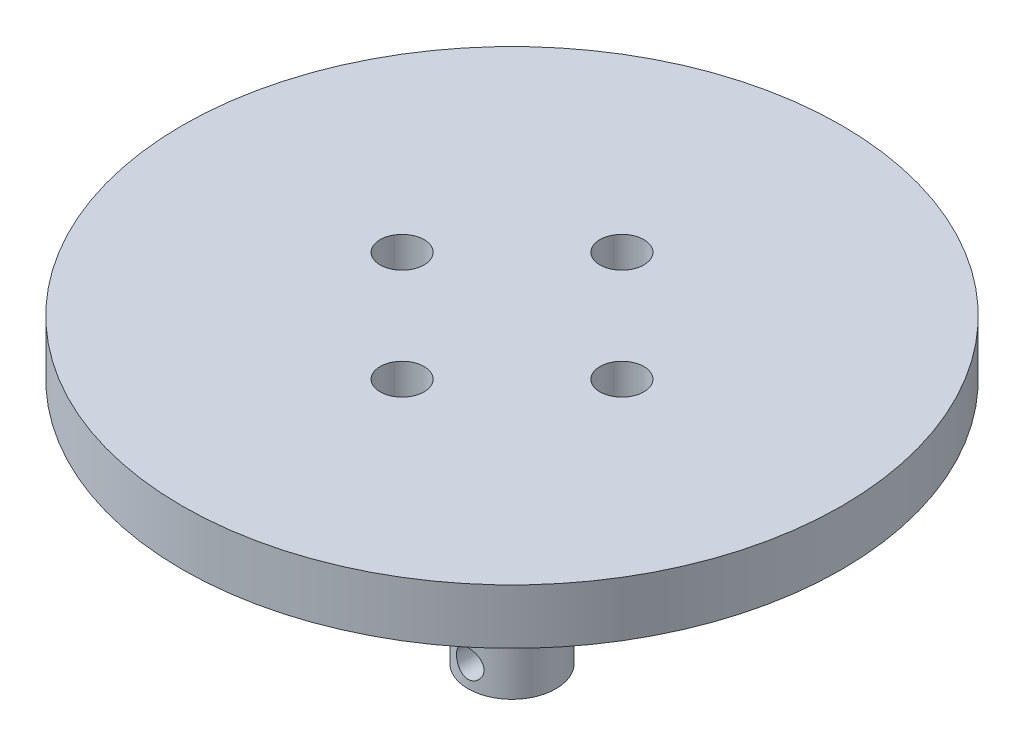
ISO-10303-21;
HEADER;
FILE_DESCRIPTION(('STEP AP214'),'2;1');
FILE_NAME('part.step','',(''),(''),'','','');
FILE_SCHEMA(('AUTOMOTIVE_DESIGN { 1 0 10303 214 1 1 1 1 }'));
ENDSEC;
DATA;
#1=APPLICATION_CONTEXT('core data for automotive mechanical design processes');
#2=APPLICATION_PROTOCOL_DEFINITION('international standard','automotive_design',2000,#1);
#3=PRODUCT_CONTEXT('',#1,'mechanical');
#4=PRODUCT('Part','Part','',(#3));
#5=PRODUCT_RELATED_PRODUCT_CATEGORY('part','',(#4));
#6=PRODUCT_DEFINITION_FORMATION('','',#4);
#7=PRODUCT_DEFINITION_CONTEXT('part definition',#1,'design');
#8=PRODUCT_DEFINITION('design','',#6,#7);
#9=PRODUCT_DEFINITION_SHAPE('','',#8);
#10=(LENGTH_UNIT() NAMED_UNIT(*) SI_UNIT(.MILLI.,.METRE.));
#11=(NAMED_UNIT(*) PLANE_ANGLE_UNIT() SI_UNIT($,.RADIAN.));
#12=(NAMED_UNIT(*) SI_UNIT($,.STERADIAN.) SOLID_ANGLE_UNIT());
#13=UNCERTAINTY_MEASURE_WITH_UNIT(LENGTH_MEASURE(1.E-05),#10,'distance_accuracy_value','');
#14=(GEOMETRIC_REPRESENTATION_CONTEXT(3) GLOBAL_UNCERTAINTY_ASSIGNED_CONTEXT((#13)) GLOBAL_UNIT_ASSIGNED_CONTEXT((#10,
#11,#12)) REPRESENTATION_CONTEXT('',''));
#15=CARTESIAN_POINT('',(0.,0.,0.));
#16=DIRECTION('',(0.,0.,1.));
#17=DIRECTION('',(1.,0.,0.));
#18=AXIS2_PLACEMENT_3D('',#15,#16,#17);
#19=CARTESIAN_POINT('',(0.,25.4,0.));
#20=DIRECTION('',(0.,-1.,0.));
#21=DIRECTION('',(0.,0.,-1.));
#22=AXIS2_PLACEMENT_3D('',#19,#20,#21);
#23=CYLINDRICAL_SURFACE('',#22,4.);
#24=CARTESIAN_POINT('',(0.,3.,0.));
#25=DIRECTION('',(0.,1.,0.));
#26=DIRECTION('',(0.,0.,1.));
#27=AXIS2_PLACEMENT_3D('',#24,#25,#26);
#28=CIRCLE('',#27,4.);
#29=CARTESIAN_POINT('',(0.,3.,4.));
#30=VERTEX_POINT('',#29);
#31=EDGE_CURVE('E78',#30,#30,#28,.T.);
#32=ORIENTED_EDGE('',*,*,#31,.T.);
#33=EDGE_LOOP('',(#32));
#34=FACE_BOUND('',#33,.T.);
#35=CARTESIAN_POINT('',(0.,25.4,0.));
#36=DIRECTION('',(0.,1.,0.));
#37=DIRECTION('',(0.,0.,1.));
#38=AXIS2_PLACEMENT_3D('',#35,#36,#37);
#39=CIRCLE('',#38,4.);
#40=CARTESIAN_POINT('',(0.,25.4,4.));
#41=VERTEX_POINT('',#40);
#42=EDGE_CURVE('E46',#41,#41,#39,.T.);
#43=ORIENTED_EDGE('',*,*,#42,.F.);
#44=EDGE_LOOP('',(#43));
#45=FACE_BOUND('',#44,.T.);
#46=CARTESIAN_POINT('',(-1.25,5.,3.79967103839267));
#47=CARTESIAN_POINT('',(-1.24999953780047,4.93165296389066,3.79967145961936));
#48=CARTESIAN_POINT('',(-1.24437538791495,4.8633012312968,3.80153531505043));
#49=CARTESIAN_POINT('',(-1.22209175401327,4.72860583912219,3.80875638998877));
#50=CARTESIAN_POINT('',(-1.20542928782515,4.66226272726784,3.81411455353136));
#51=CARTESIAN_POINT('',(-1.16169788223559,4.533555098068,3.8276593883596));
#52=CARTESIAN_POINT('',(-1.13464735736677,4.47118376689432,3.83584105194317));
#53=CARTESIAN_POINT('',(-1.07096914173157,4.35184730413599,3.85410406218688));
#54=CARTESIAN_POINT('',(-1.03433975905632,4.29488313003988,3.86418574435841));
#55=CARTESIAN_POINT('',(-0.951196070622293,4.18602113250651,3.8855012766862));
#56=CARTESIAN_POINT('',(-0.904409399720398,4.13433639056401,3.8967612338478));
#57=CARTESIAN_POINT('',(-0.802862046455494,4.03940398679081,3.91894245860336));
#58=CARTESIAN_POINT('',(-0.748100252518564,3.99615750305515,3.92986367872627));
#59=CARTESIAN_POINT('',(-0.630625912493362,3.91838893698875,3.95043553390078));
#60=CARTESIAN_POINT('',(-0.567761556520094,3.88408629616854,3.9600518456278));
#61=CARTESIAN_POINT('',(-0.436804232853403,3.82662395014445,3.97662551833019));
#62=CARTESIAN_POINT('',(-0.368712498487051,3.80346162585041,3.98358350419919));
#63=CARTESIAN_POINT('',(-0.231464356966097,3.76964887190293,3.99387175820863));
#64=CARTESIAN_POINT('',(-0.162405715468215,3.75863425021215,3.99730738984143));
#65=CARTESIAN_POINT('',(-0.02334081398452,3.74827565356247,4.00053595876015));
#66=CARTESIAN_POINT('',(0.0466652269730837,3.74892902564117,4.00032972410065));
#67=CARTESIAN_POINT('',(0.183074480354735,3.76164829158595,3.99637116132537));
#68=CARTESIAN_POINT('',(0.249518634314044,3.77331938351302,3.99274150972157));
#69=CARTESIAN_POINT('',(0.37945306334777,3.807094990043,3.98249482560855));
#70=CARTESIAN_POINT('',(0.442943145481196,3.82920018508655,3.97587759827134));
#71=CARTESIAN_POINT('',(0.566078103154782,3.88347018907488,3.96023459729533));
#72=CARTESIAN_POINT('',(0.625666405622831,3.91575480856303,3.95118033616957));
#73=CARTESIAN_POINT('',(0.73870251115203,3.98937109970456,3.93161722953562));
#74=CARTESIAN_POINT('',(0.792148756208838,4.03070505913784,3.92110801644584));
#75=CARTESIAN_POINT('',(0.893737698453881,4.12327363480129,3.89923670734646));
#76=CARTESIAN_POINT('',(0.941566549094178,4.1748490688412,3.88785731989084));
#77=CARTESIAN_POINT('',(1.02798974259538,4.28539510182446,3.86590615440412));
#78=CARTESIAN_POINT('',(1.06658299775341,4.344366570575,3.85533447159847));
#79=CARTESIAN_POINT('',(1.13380465019766,4.46891746885984,3.83610846648974));
#80=CARTESIAN_POINT('',(1.16231680702682,4.53456340904239,3.82747690354324));
#81=CARTESIAN_POINT('',(1.20778345948513,4.67005949189535,3.81337545338913));
#82=CARTESIAN_POINT('',(1.22474210765793,4.73990811421048,3.80790443033294));
#83=CARTESIAN_POINT('',(1.24601485185709,4.87881995256584,3.80099563391872));
#84=CARTESIAN_POINT('',(1.25080954353711,4.94780199623211,3.79940466389696));
#85=CARTESIAN_POINT('',(1.24896744498307,5.08558974149816,3.80001077463984));
#86=CARTESIAN_POINT('',(1.24233242111456,5.15439546870047,3.80220727008389));
#87=CARTESIAN_POINT('',(1.21824873513143,5.28780829665165,3.80998957482874));
#88=CARTESIAN_POINT('',(1.20111831160538,5.35247927407399,3.81547554101732));
#89=CARTESIAN_POINT('',(1.15690373661028,5.47802179199604,3.82911287331661));
#90=CARTESIAN_POINT('',(1.12981796171155,5.53889271092119,3.83726467412388));
#91=CARTESIAN_POINT('',(1.06557510655875,5.65703910977175,3.85560539653156));
#92=CARTESIAN_POINT('',(1.02815147488557,5.71416141559278,3.86584603489733));
#93=CARTESIAN_POINT('',(0.944606408679811,5.82149034636192,3.88710348972828));
#94=CARTESIAN_POINT('',(0.898482714690783,5.87169516892534,3.89812050735703));
#95=CARTESIAN_POINT('',(0.796572947753604,5.96591036591282,3.92024187562679));
#96=CARTESIAN_POINT('',(0.740465649788521,6.00957778613987,3.93133092285679));
#97=CARTESIAN_POINT('',(0.621451545651398,6.08689104332126,3.95189059843678));
#98=CARTESIAN_POINT('',(0.558545051108623,6.12053733931104,3.96136130090946));
#99=CARTESIAN_POINT('',(0.428105523331831,6.17653056247168,3.97756311928512));
#100=CARTESIAN_POINT('',(0.360610184283755,6.19895928784368,3.984313995612));
#101=CARTESIAN_POINT('',(0.222557254056389,6.23207253858971,3.99440242648576));
#102=CARTESIAN_POINT('',(0.152000628340356,6.2427607390835,3.99774104914277));
#103=CARTESIAN_POINT('',(0.0129849366488985,6.25179100174962,4.00055803404462));
#104=CARTESIAN_POINT('',(-0.0554391919465228,6.25062845017076,4.0001912940739));
#105=CARTESIAN_POINT('',(-0.191073221923249,6.2371881889513,3.99600978081049));
#106=CARTESIAN_POINT('',(-0.258283202179569,6.22491120400805,3.99219523232619));
#107=CARTESIAN_POINT('',(-0.388755118480791,6.18990599077772,3.98159570844796));
#108=CARTESIAN_POINT('',(-0.452055918449481,6.16731039215463,3.97484847960205));
#109=CARTESIAN_POINT('',(-0.573998425500091,6.11242917279152,3.9590794558795));
#110=CARTESIAN_POINT('',(-0.632639331274482,6.08014189002657,3.95005727091358));
#111=CARTESIAN_POINT('',(-0.745761694969689,6.00552724165556,3.93029896883376));
#112=CARTESIAN_POINT('',(-0.800034607053111,5.96289647753603,3.91951509750962));
#113=CARTESIAN_POINT('',(-0.900820791399319,5.86934011055654,3.89758736547061));
#114=CARTESIAN_POINT('',(-0.94733173350416,5.81841202586061,3.88644339784826));
#115=CARTESIAN_POINT('',(-1.03282865911253,5.7076842801589,3.86461892577438));
#116=CARTESIAN_POINT('',(-1.07151427994711,5.64764659688342,3.85396600863456));
#117=CARTESIAN_POINT('',(-1.13820470748522,5.52160187973086,3.83480125279531));
#118=CARTESIAN_POINT('',(-1.16621383403546,5.45559727354975,3.82628854861386));
#119=CARTESIAN_POINT('',(-1.20871180435792,5.32527738268533,3.81306560440328));
#120=CARTESIAN_POINT('',(-1.22414939837873,5.26129745254844,3.80809315043749));
#121=CARTESIAN_POINT('',(-1.244792458161,5.13154616790351,3.80139606482399));
#122=CARTESIAN_POINT('',(-1.25000044480778,5.0657752587985,3.79967063301598));
#123=CARTESIAN_POINT('',(-1.25,5.,3.79967103839267));
#124=B_SPLINE_CURVE_WITH_KNOTS('',3,(#46,#47,#48,#49,#50,#51,#52,#53,#54,#55,#56,#57,#58,#59,
#60,#61,#62,#63,#64,#65,#66,#67,#68,#69,#70,#71,#72,#73,#74,#75,#76,#77,#78,#79,#80,#81,#82,#83,
#84,#85,#86,#87,#88,#89,#90,#91,#92,#93,#94,#95,#96,#97,#98,#99,#100,#101,#102,#103,#104,#105,
#106,#107,#108,#109,#110,#111,#112,#113,#114,#115,#116,#117,#118,#119,#120,#121,#122,#123),
.UNSPECIFIED.,.T.,.F.,(4,2,2,2,2,2,2,2,2,2,2,2,2,2,2,2,2,2,2,2,2,2,2,2,2,2,2,2,2,2,2,2,2,2,2,2,
2,2,4),(0.,0.20479813754849,0.409651627059736,0.614143644118582,0.818671804924948,
1.02957080550838,1.24049922941123,1.45619821963733,1.67184647417922,1.88083722835534,
2.08978046471775,2.29150982969751,2.49325235190093,2.69746404608409,2.90172742713188,
3.11450338937334,3.32730439853776,3.54248470934454,3.75758763952753,3.96404933287936,
4.1704791221909,4.37093972044363,4.5714330225321,4.77767613309611,4.9839728801188,
5.19881937811511,5.41365603317087,5.62690239290998,5.84008198140585,6.04438802439525,
6.24868074692307,6.4504184651476,6.65219079911652,6.86080693105215,7.06948557772191,
7.28507795501705,7.50058300803822,7.69772354371386,7.89481549188779),.UNSPECIFIED.);
#125=CARTESIAN_POINT('',(-1.25,5.,3.79967103839267));
#126=VERTEX_POINT('',#125);
#127=EDGE_CURVE('E67',#126,#126,#124,.T.);
#128=ORIENTED_EDGE('',*,*,#127,.F.);
#129=EDGE_LOOP('',(#128));
#130=FACE_BOUND('',#129,.T.);
#131=ADVANCED_FACE('F37',(#34,#45,#130),#23,.T.);
#132=CARTESIAN_POINT('',(0.,30.4,0.));
#133=DIRECTION('',(0.,-1.,0.));
#134=DIRECTION('',(0.,0.,-1.));
#135=AXIS2_PLACEMENT_3D('',#132,#133,#134);
#136=CYLINDRICAL_SURFACE('',#135,30.);
#137=CARTESIAN_POINT('',(0.,30.4,0.));
#138=DIRECTION('',(0.,1.,0.));
#139=DIRECTION('',(0.,0.,1.));
#140=AXIS2_PLACEMENT_3D('',#137,#138,#139);
#141=CIRCLE('',#140,30.);
#142=CARTESIAN_POINT('',(0.,30.4,30.));
#143=VERTEX_POINT('',#142);
#144=EDGE_CURVE('E101',#143,#143,#141,.T.);
#145=ORIENTED_EDGE('',*,*,#144,.F.);
#146=EDGE_LOOP('',(#145));
#147=FACE_BOUND('',#146,.T.);
#148=CARTESIAN_POINT('',(0.,25.4,0.));
#149=DIRECTION('',(0.,1.,0.));
#150=DIRECTION('',(0.,0.,1.));
#151=AXIS2_PLACEMENT_3D('',#148,#149,#150);
#152=CIRCLE('',#151,30.);
#153=CARTESIAN_POINT('',(0.,25.4,30.));
#154=VERTEX_POINT('',#153);
#155=EDGE_CURVE('E88',#154,#154,#152,.T.);
#156=ORIENTED_EDGE('',*,*,#155,.T.);
#157=EDGE_LOOP('',(#156));
#158=FACE_BOUND('',#157,.T.);
#159=ADVANCED_FACE('F158',(#147,#158),#136,.T.);
#160=CARTESIAN_POINT('',(0.,30.4,0.));
#161=DIRECTION('',(0.,1.,0.));
#162=DIRECTION('',(0.,0.,1.));
#163=AXIS2_PLACEMENT_3D('',#160,#161,#162);
#164=PLANE('',#163);
#165=CARTESIAN_POINT('',(0.,30.4,-10.));
#166=DIRECTION('',(0.,1.,0.));
#167=DIRECTION('',(0.,0.,1.));
#168=AXIS2_PLACEMENT_3D('',#165,#166,#167);
#169=CIRCLE('',#168,2.);
#170=CARTESIAN_POINT('',(0.,30.4,-8.));
#171=VERTEX_POINT('',#170);
#172=EDGE_CURVE('E98',#171,#171,#169,.T.);
#173=ORIENTED_EDGE('',*,*,#172,.F.);
#174=EDGE_LOOP('',(#173));
#175=FACE_BOUND('',#174,.T.);
#176=CARTESIAN_POINT('',(10.0000000000003,30.4,-2.82380124105319E-13));
#177=DIRECTION('',(0.,1.,0.));
#178=DIRECTION('',(0.,0.,1.));
#179=AXIS2_PLACEMENT_3D('',#176,#177,#178);
#180=CIRCLE('',#179,2.00000000000022);
#181=CARTESIAN_POINT('',(10.0000000000003,30.4,1.99999999999994));
#182=VERTEX_POINT('',#181);
#183=EDGE_CURVE('E111',#182,#182,#180,.T.);
#184=ORIENTED_EDGE('',*,*,#183,.F.);
#185=EDGE_LOOP('',(#184));
#186=FACE_BOUND('',#185,.T.);
#187=CARTESIAN_POINT('',(5.64760248210638E-13,30.4,10.));
#188=DIRECTION('',(0.,1.,0.));
#189=DIRECTION('',(0.,0.,1.));
#190=AXIS2_PLACEMENT_3D('',#187,#188,#189);
#191=CIRCLE('',#190,2.00000000000061);
#192=CARTESIAN_POINT('',(5.64760248210638E-13,30.4,12.0000000000006));
#193=VERTEX_POINT('',#192);
#194=EDGE_CURVE('E108',#193,#193,#191,.T.);
#195=ORIENTED_EDGE('',*,*,#194,.F.);
#196=EDGE_LOOP('',(#195));
#197=FACE_BOUND('',#196,.T.);
#198=CARTESIAN_POINT('',(-9.99999999999972,30.4,2.83604770904466E-13));
#199=DIRECTION('',(0.,1.,0.));
#200=DIRECTION('',(0.,0.,1.));
#201=AXIS2_PLACEMENT_3D('',#198,#199,#200);
#202=CIRCLE('',#201,2.00000000000045);
#203=CARTESIAN_POINT('',(-9.99999999999972,30.4,2.00000000000074));
#204=VERTEX_POINT('',#203);
#205=EDGE_CURVE('E81',#204,#204,#202,.T.);
#206=ORIENTED_EDGE('',*,*,#205,.F.);
#207=EDGE_LOOP('',(#206));
#208=FACE_BOUND('',#207,.T.);
#209=ORIENTED_EDGE('',*,*,#144,.T.);
#210=EDGE_LOOP('',(#209));
#211=FACE_BOUND('',#210,.T.);
#212=ADVANCED_FACE('F155',(#175,#186,#197,#208,#211),#164,.T.);
#213=CARTESIAN_POINT('',(0.,25.4,0.));
#214=DIRECTION('',(0.,1.,0.));
#215=DIRECTION('',(0.,0.,1.));
#216=AXIS2_PLACEMENT_3D('',#213,#214,#215);
#217=PLANE('',#216);
#218=CARTESIAN_POINT('',(0.,25.4,-10.));
#219=DIRECTION('',(0.,1.,0.));
#220=DIRECTION('',(0.,0.,1.));
#221=AXIS2_PLACEMENT_3D('',#218,#219,#220);
#222=CIRCLE('',#221,2.);
#223=CARTESIAN_POINT('',(0.,25.4,-8.));
#224=VERTEX_POINT('',#223);
#225=EDGE_CURVE('E85',#224,#224,#222,.T.);
#226=ORIENTED_EDGE('',*,*,#225,.T.);
#227=EDGE_LOOP('',(#226));
#228=FACE_BOUND('',#227,.T.);
#229=CARTESIAN_POINT('',(10.0000000000003,25.4,-2.82380124105319E-13));
#230=DIRECTION('',(0.,1.,0.));
#231=DIRECTION('',(0.,0.,1.));
#232=AXIS2_PLACEMENT_3D('',#229,#230,#231);
#233=CIRCLE('',#232,2.00000000000022);
#234=CARTESIAN_POINT('',(10.0000000000003,25.4,1.99999999999994));
#235=VERTEX_POINT('',#234);
#236=EDGE_CURVE('E89',#235,#235,#233,.T.);
#237=ORIENTED_EDGE('',*,*,#236,.T.);
#238=EDGE_LOOP('',(#237));
#239=FACE_BOUND('',#238,.T.);
#240=CARTESIAN_POINT('',(5.64760248210638E-13,25.4,10.));
#241=DIRECTION('',(0.,1.,0.));
#242=DIRECTION('',(0.,0.,1.));
#243=AXIS2_PLACEMENT_3D('',#240,#241,#242);
#244=CIRCLE('',#243,2.00000000000061);
#245=CARTESIAN_POINT('',(5.64760248210638E-13,25.4,12.0000000000006));
#246=VERTEX_POINT('',#245);
#247=EDGE_CURVE('E92',#246,#246,#244,.T.);
#248=ORIENTED_EDGE('',*,*,#247,.T.);
#249=EDGE_LOOP('',(#248));
#250=FACE_BOUND('',#249,.T.);
#251=CARTESIAN_POINT('',(-9.99999999999972,25.4,2.83604770904466E-13));
#252=DIRECTION('',(0.,1.,0.));
#253=DIRECTION('',(0.,0.,1.));
#254=AXIS2_PLACEMENT_3D('',#251,#252,#253);
#255=CIRCLE('',#254,2.00000000000045);
#256=CARTESIAN_POINT('',(-9.99999999999972,25.4,2.00000000000074));
#257=VERTEX_POINT('',#256);
#258=EDGE_CURVE('E95',#257,#257,#255,.T.);
#259=ORIENTED_EDGE('',*,*,#258,.T.);
#260=EDGE_LOOP('',(#259));
#261=FACE_BOUND('',#260,.T.);
#262=ORIENTED_EDGE('',*,*,#42,.T.);
#263=EDGE_LOOP('',(#262));
#264=FACE_BOUND('',#263,.T.);
#265=ORIENTED_EDGE('',*,*,#155,.F.);
#266=EDGE_LOOP('',(#265));
#267=FACE_BOUND('',#266,.T.);
#268=ADVANCED_FACE('F153',(#228,#239,#250,#261,#264,#267),#217,.F.);
#269=CARTESIAN_POINT('',(-9.99999999999972,22.9,2.83604770904466E-13));
#270=DIRECTION('',(0.,1.,0.));
#271=DIRECTION('',(0.,0.,1.));
#272=AXIS2_PLACEMENT_3D('',#269,#270,#271);
#273=CYLINDRICAL_SURFACE('',#272,2.00000000000045);
#274=ORIENTED_EDGE('',*,*,#205,.T.);
#275=EDGE_LOOP('',(#274));
#276=FACE_BOUND('',#275,.T.);
#277=ORIENTED_EDGE('',*,*,#258,.F.);
#278=EDGE_LOOP('',(#277));
#279=FACE_BOUND('',#278,.T.);
#280=ADVANCED_FACE('F149',(#276,#279),#273,.F.);
#281=CARTESIAN_POINT('',(5.64760248210638E-13,22.9,10.));
#282=DIRECTION('',(0.,1.,0.));
#283=DIRECTION('',(0.,0.,1.));
#284=AXIS2_PLACEMENT_3D('',#281,#282,#283);
#285=CYLINDRICAL_SURFACE('',#284,2.00000000000061);
#286=ORIENTED_EDGE('',*,*,#194,.T.);
#287=EDGE_LOOP('',(#286));
#288=FACE_BOUND('',#287,.T.);
#289=ORIENTED_EDGE('',*,*,#247,.F.);
#290=EDGE_LOOP('',(#289));
#291=FACE_BOUND('',#290,.T.);
#292=ADVANCED_FACE('F145',(#288,#291),#285,.F.);
#293=CARTESIAN_POINT('',(10.0000000000003,22.9,-2.82380124105319E-13));
#294=DIRECTION('',(0.,1.,0.));
#295=DIRECTION('',(0.,0.,1.));
#296=AXIS2_PLACEMENT_3D('',#293,#294,#295);
#297=CYLINDRICAL_SURFACE('',#296,2.00000000000022);
#298=ORIENTED_EDGE('',*,*,#183,.T.);
#299=EDGE_LOOP('',(#298));
#300=FACE_BOUND('',#299,.T.);
#301=ORIENTED_EDGE('',*,*,#236,.F.);
#302=EDGE_LOOP('',(#301));
#303=FACE_BOUND('',#302,.T.);
#304=ADVANCED_FACE('F141',(#300,#303),#297,.F.);
#305=CARTESIAN_POINT('',(0.,22.9,-10.));
#306=DIRECTION('',(0.,1.,0.));
#307=DIRECTION('',(0.,0.,1.));
#308=AXIS2_PLACEMENT_3D('',#305,#306,#307);
#309=CYLINDRICAL_SURFACE('',#308,2.);
#310=ORIENTED_EDGE('',*,*,#172,.T.);
#311=EDGE_LOOP('',(#310));
#312=FACE_BOUND('',#311,.T.);
#313=ORIENTED_EDGE('',*,*,#225,.F.);
#314=EDGE_LOOP('',(#313));
#315=FACE_BOUND('',#314,.T.);
#316=ADVANCED_FACE('F138',(#312,#315),#309,.F.);
#317=CARTESIAN_POINT('',(0.,3.,0.));
#318=DIRECTION('',(0.,-1.,0.));
#319=DIRECTION('',(0.,0.,-1.));
#320=AXIS2_PLACEMENT_3D('',#317,#318,#319);
#321=PLANE('',#320);
#322=CARTESIAN_POINT('',(0.,3.,0.));
#323=DIRECTION('',(0.,-1.,0.));
#324=DIRECTION('',(0.,0.,-1.));
#325=AXIS2_PLACEMENT_3D('',#322,#323,#324);
#326=CIRCLE('',#325,2.05);
#327=CARTESIAN_POINT('',(1.28160056179763,3.,1.6));
#328=VERTEX_POINT('',#327);
#329=CARTESIAN_POINT('',(-1.28160056179763,3.,1.6));
#330=VERTEX_POINT('',#329);
#331=EDGE_CURVE('E72',#328,#330,#326,.F.);
#332=ORIENTED_EDGE('',*,*,#331,.T.);
#333=DIRECTION('',(1.,0.,0.));
#334=VECTOR('',#333,1.);
#335=CARTESIAN_POINT('',(0.,3.,1.6));
#336=LINE('',#335,#334);
#337=EDGE_CURVE('E61',#330,#328,#336,.T.);
#338=ORIENTED_EDGE('',*,*,#337,.T.);
#339=EDGE_LOOP('',(#332,#338));
#340=FACE_BOUND('',#339,.T.);
#341=ORIENTED_EDGE('',*,*,#31,.F.);
#342=EDGE_LOOP('',(#341));
#343=FACE_BOUND('',#342,.T.);
#344=ADVANCED_FACE('F76',(#340,#343),#321,.T.);
#345=CARTESIAN_POINT('',(0.,7.4,0.));
#346=DIRECTION('',(0.,-1.,0.));
#347=DIRECTION('',(0.,0.,-1.));
#348=AXIS2_PLACEMENT_3D('',#345,#346,#347);
#349=CYLINDRICAL_SURFACE('',#348,2.05);
#350=DIRECTION('',(0.,-1.,0.));
#351=VECTOR('',#350,1.);
#352=CARTESIAN_POINT('',(1.28160056179763,13.,1.6));
#353=LINE('',#352,#351);
#354=CARTESIAN_POINT('',(1.28160056179763,7.4,1.6));
#355=VERTEX_POINT('',#354);
#356=EDGE_CURVE('E63',#355,#328,#353,.T.);
#357=ORIENTED_EDGE('',*,*,#356,.F.);
#358=CARTESIAN_POINT('',(0.,7.4,0.));
#359=DIRECTION('',(0.,1.,0.));
#360=DIRECTION('',(0.,0.,1.));
#361=AXIS2_PLACEMENT_3D('',#358,#359,#360);
#362=CIRCLE('',#361,2.05);
#363=CARTESIAN_POINT('',(-1.28160056179763,7.4,1.6));
#364=VERTEX_POINT('',#363);
#365=EDGE_CURVE('E74',#355,#364,#362,.T.);
#366=ORIENTED_EDGE('',*,*,#365,.T.);
#367=DIRECTION('',(0.,-1.,0.));
#368=VECTOR('',#367,1.);
#369=CARTESIAN_POINT('',(-1.28160056179763,13.,1.6));
#370=LINE('',#369,#368);
#371=EDGE_CURVE('E53',#364,#330,#370,.T.);
#372=ORIENTED_EDGE('',*,*,#371,.T.);
#373=ORIENTED_EDGE('',*,*,#331,.F.);
#374=EDGE_LOOP('',(#357,#366,#372,#373));
#375=FACE_BOUND('',#374,.T.);
#376=ADVANCED_FACE('F71',(#375),#349,.F.);
#377=CARTESIAN_POINT('',(0.,7.4,0.));
#378=DIRECTION('',(0.,1.,0.));
#379=DIRECTION('',(0.,0.,1.));
#380=AXIS2_PLACEMENT_3D('',#377,#378,#379);
#381=PLANE('',#380);
#382=ORIENTED_EDGE('',*,*,#365,.F.);
#383=DIRECTION('',(-1.,0.,0.));
#384=VECTOR('',#383,1.);
#385=CARTESIAN_POINT('',(0.,7.4,1.6));
#386=LINE('',#385,#384);
#387=EDGE_CURVE('E11',#355,#364,#386,.T.);
#388=ORIENTED_EDGE('',*,*,#387,.T.);
#389=EDGE_LOOP('',(#382,#388));
#390=FACE_BOUND('',#389,.T.);
#391=ADVANCED_FACE('F129',(#390),#381,.F.);
#392=CARTESIAN_POINT('',(0.,13.,1.6));
#393=DIRECTION('',(0.,0.,-1.));
#394=DIRECTION('',(-1.,0.,0.));
#395=AXIS2_PLACEMENT_3D('',#392,#393,#394);
#396=PLANE('',#395);
#397=CARTESIAN_POINT('',(0.,5.,1.6));
#398=DIRECTION('',(0.,0.,-1.));
#399=DIRECTION('',(-1.,0.,0.));
#400=AXIS2_PLACEMENT_3D('',#397,#398,#399);
#401=CIRCLE('',#400,1.25);
#402=CARTESIAN_POINT('',(-1.25,5.,1.6));
#403=VERTEX_POINT('',#402);
#404=EDGE_CURVE('E41',#403,#403,#401,.F.);
#405=ORIENTED_EDGE('',*,*,#404,.T.);
#406=EDGE_LOOP('',(#405));
#407=FACE_BOUND('',#406,.T.);
#408=ORIENTED_EDGE('',*,*,#387,.F.);
#409=ORIENTED_EDGE('',*,*,#356,.T.);
#410=ORIENTED_EDGE('',*,*,#337,.F.);
#411=ORIENTED_EDGE('',*,*,#371,.F.);
#412=EDGE_LOOP('',(#408,#409,#410,#411));
#413=FACE_BOUND('',#412,.T.);
#414=ADVANCED_FACE('F62',(#407,#413),#396,.T.);
#415=CARTESIAN_POINT('',(0.,5.,10.));
#416=DIRECTION('',(0.,0.,-1.));
#417=DIRECTION('',(-1.,0.,0.));
#418=AXIS2_PLACEMENT_3D('',#415,#416,#417);
#419=CYLINDRICAL_SURFACE('',#418,1.25);
#420=ORIENTED_EDGE('',*,*,#404,.F.);
#421=EDGE_LOOP('',(#420));
#422=FACE_BOUND('',#421,.T.);
#423=ORIENTED_EDGE('',*,*,#127,.T.);
#424=EDGE_LOOP('',(#423));
#425=FACE_BOUND('',#424,.T.);
#426=ADVANCED_FACE('F122',(#422,#425),#419,.F.);
#427=CLOSED_SHELL('',(#131,#159,#212,#268,#280,#292,#304,#316,#344,#376,#391,#414,#426));
#428=MANIFOLD_SOLID_BREP('B2',#427);
#429=ADVANCED_BREP_SHAPE_REPRESENTATION('',(#18,#428),#14);
#430=SHAPE_DEFINITION_REPRESENTATION(#9,#429);
ENDSEC;
END-ISO-10303-21;
